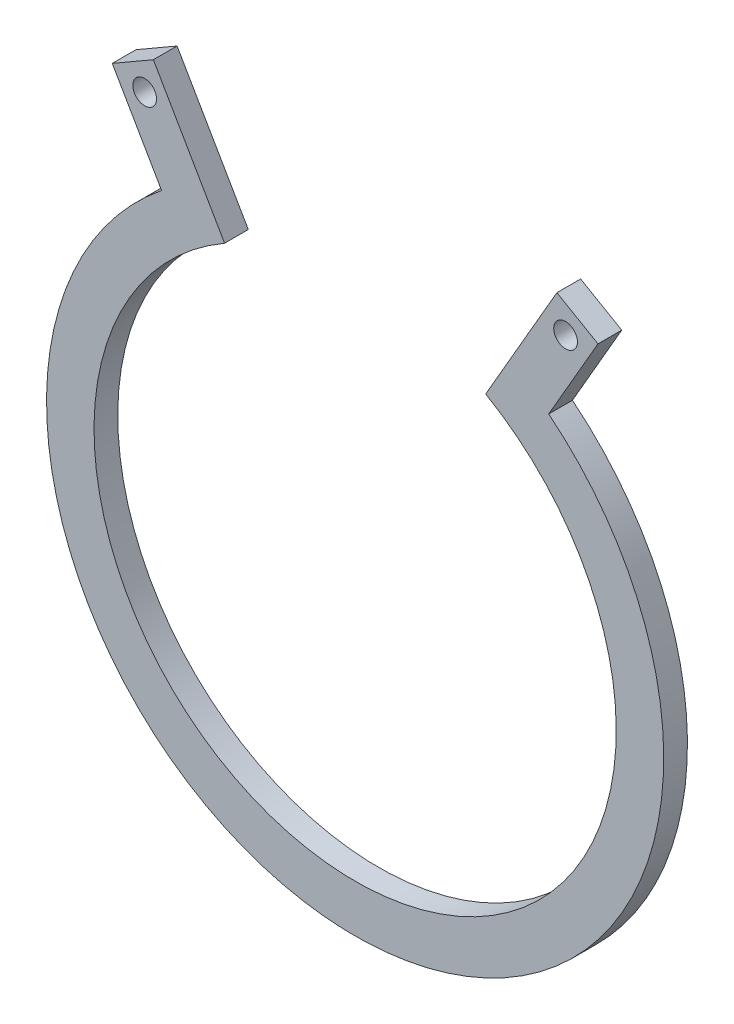
ISO-10303-21;
HEADER;
FILE_DESCRIPTION(('STEP AP214'),'2;1');
FILE_NAME('part.step','',(''),(''),'','','');
FILE_SCHEMA(('AUTOMOTIVE_DESIGN { 1 0 10303 214 1 1 1 1 }'));
ENDSEC;
DATA;
#1=APPLICATION_CONTEXT('core data for automotive mechanical design processes');
#2=APPLICATION_PROTOCOL_DEFINITION('international standard','automotive_design',2000,#1);
#3=PRODUCT_CONTEXT('',#1,'mechanical');
#4=PRODUCT('Part','Part','',(#3));
#5=PRODUCT_RELATED_PRODUCT_CATEGORY('part','',(#4));
#6=PRODUCT_DEFINITION_FORMATION('','',#4);
#7=PRODUCT_DEFINITION_CONTEXT('part definition',#1,'design');
#8=PRODUCT_DEFINITION('design','',#6,#7);
#9=PRODUCT_DEFINITION_SHAPE('','',#8);
#10=(LENGTH_UNIT() NAMED_UNIT(*) SI_UNIT(.MILLI.,.METRE.));
#11=(NAMED_UNIT(*) PLANE_ANGLE_UNIT() SI_UNIT($,.RADIAN.));
#12=(NAMED_UNIT(*) SI_UNIT($,.STERADIAN.) SOLID_ANGLE_UNIT());
#13=UNCERTAINTY_MEASURE_WITH_UNIT(LENGTH_MEASURE(1.E-05),#10,'distance_accuracy_value','');
#14=(GEOMETRIC_REPRESENTATION_CONTEXT(3) GLOBAL_UNCERTAINTY_ASSIGNED_CONTEXT((#13)) GLOBAL_UNIT_ASSIGNED_CONTEXT((#10,
#11,#12)) REPRESENTATION_CONTEXT('',''));
#15=CARTESIAN_POINT('',(0.,0.,0.));
#16=DIRECTION('',(0.,0.,1.));
#17=DIRECTION('',(1.,0.,0.));
#18=AXIS2_PLACEMENT_3D('',#15,#16,#17);
#19=CARTESIAN_POINT('',(0.,0.,3.175));
#20=DIRECTION('',(0.,0.,-1.));
#21=DIRECTION('',(-1.,0.,0.));
#22=AXIS2_PLACEMENT_3D('',#19,#20,#21);
#23=CYLINDRICAL_SURFACE('',#22,41.275);
#24=DIRECTION('',(0.,0.,1.));
#25=VECTOR('',#24,1.);
#26=CARTESIAN_POINT('',(25.8910680326626,32.1446452947927,-18.8026064702955));
#27=LINE('',#26,#25);
#28=CARTESIAN_POINT('',(25.8910680326626,32.1446452947927,0.));
#29=VERTEX_POINT('',#28);
#30=CARTESIAN_POINT('',(25.8910680326626,32.1446452947927,3.175));
#31=VERTEX_POINT('',#30);
#32=EDGE_CURVE('E58',#29,#31,#27,.T.);
#33=ORIENTED_EDGE('',*,*,#32,.T.);
#34=CARTESIAN_POINT('',(0.,0.,3.175));
#35=DIRECTION('',(0.,0.,1.));
#36=DIRECTION('',(1.,0.,0.));
#37=AXIS2_PLACEMENT_3D('',#34,#35,#36);
#38=CIRCLE('',#37,41.275);
#39=CARTESIAN_POINT('',(-25.8910680326626,32.1446452947927,3.175));
#40=VERTEX_POINT('',#39);
#41=EDGE_CURVE('E50',#40,#31,#38,.T.);
#42=ORIENTED_EDGE('',*,*,#41,.F.);
#43=DIRECTION('',(0.,0.,1.));
#44=VECTOR('',#43,1.);
#45=CARTESIAN_POINT('',(-25.8910680326626,32.1446452947927,-18.8026064702955));
#46=LINE('',#45,#44);
#47=CARTESIAN_POINT('',(-25.8910680326626,32.1446452947927,0.));
#48=VERTEX_POINT('',#47);
#49=EDGE_CURVE('E146',#48,#40,#46,.T.);
#50=ORIENTED_EDGE('',*,*,#49,.F.);
#51=CARTESIAN_POINT('',(0.,0.,0.));
#52=DIRECTION('',(0.,0.,1.));
#53=DIRECTION('',(1.,0.,0.));
#54=AXIS2_PLACEMENT_3D('',#51,#52,#53);
#55=CIRCLE('',#54,41.275);
#56=EDGE_CURVE('E63',#48,#29,#55,.T.);
#57=ORIENTED_EDGE('',*,*,#56,.T.);
#58=EDGE_LOOP('',(#33,#42,#50,#57));
#59=FACE_BOUND('',#58,.T.);
#60=ADVANCED_FACE('F41',(#59),#23,.T.);
#61=CARTESIAN_POINT('',(0.,0.,3.175));
#62=DIRECTION('',(0.,0.,-1.));
#63=DIRECTION('',(-1.,0.,0.));
#64=AXIS2_PLACEMENT_3D('',#61,#62,#63);
#65=CYLINDRICAL_SURFACE('',#64,34.925);
#66=DIRECTION('',(0.,0.,-1.));
#67=VECTOR('',#66,1.);
#68=CARTESIAN_POINT('',(17.4625,30.2459372271715,3.175));
#69=LINE('',#68,#67);
#70=CARTESIAN_POINT('',(17.4625,30.2459372271715,0.));
#71=VERTEX_POINT('',#70);
#72=CARTESIAN_POINT('',(17.4625,30.2459372271715,3.175));
#73=VERTEX_POINT('',#72);
#74=EDGE_CURVE('E127',#71,#73,#69,.F.);
#75=ORIENTED_EDGE('',*,*,#74,.F.);
#76=CARTESIAN_POINT('',(0.,0.,0.));
#77=DIRECTION('',(0.,0.,1.));
#78=DIRECTION('',(1.,0.,0.));
#79=AXIS2_PLACEMENT_3D('',#76,#77,#78);
#80=CIRCLE('',#79,34.925);
#81=CARTESIAN_POINT('',(-17.4625000000003,30.2459372271714,0.));
#82=VERTEX_POINT('',#81);
#83=EDGE_CURVE('E44',#82,#71,#80,.T.);
#84=ORIENTED_EDGE('',*,*,#83,.F.);
#85=DIRECTION('',(0.,0.,-1.));
#86=VECTOR('',#85,1.);
#87=CARTESIAN_POINT('',(-17.4625000000002,30.2459372271714,3.175));
#88=LINE('',#87,#86);
#89=CARTESIAN_POINT('',(-17.4625000000003,30.2459372271714,3.175));
#90=VERTEX_POINT('',#89);
#91=EDGE_CURVE('E120',#90,#82,#88,.T.);
#92=ORIENTED_EDGE('',*,*,#91,.F.);
#93=CARTESIAN_POINT('',(0.,0.,3.175));
#94=DIRECTION('',(0.,0.,1.));
#95=DIRECTION('',(1.,0.,0.));
#96=AXIS2_PLACEMENT_3D('',#93,#94,#95);
#97=CIRCLE('',#96,34.925);
#98=EDGE_CURVE('E11',#90,#73,#97,.T.);
#99=ORIENTED_EDGE('',*,*,#98,.T.);
#100=EDGE_LOOP('',(#75,#84,#92,#99));
#101=FACE_BOUND('',#100,.T.);
#102=ADVANCED_FACE('F130',(#101),#65,.F.);
#103=CARTESIAN_POINT('',(0.,0.,3.175));
#104=DIRECTION('',(0.,0.,1.));
#105=DIRECTION('',(1.,0.,0.));
#106=AXIS2_PLACEMENT_3D('',#103,#104,#105);
#107=PLANE('',#106);
#108=DIRECTION('',(-0.500000000000024,-0.866025403784425,0.));
#109=VECTOR('',#108,1.);
#110=CARTESIAN_POINT('',(-9.85518376771561E-13,5.6898930012042E-13,3.175));
#111=LINE('',#110,#109);
#112=CARTESIAN_POINT('',(26.9875000000003,46.7437211692649,3.175));
#113=VERTEX_POINT('',#112);
#114=EDGE_CURVE('E192',#113,#73,#111,.T.);
#115=ORIENTED_EDGE('',*,*,#114,.T.);
#116=ORIENTED_EDGE('',*,*,#98,.F.);
#117=DIRECTION('',(-0.5,0.866025403784439,0.));
#118=VECTOR('',#117,1.);
#119=CARTESIAN_POINT('',(-3.00462919747432E-13,-1.73472347597681E-13,3.175));
#120=LINE('',#119,#118);
#121=CARTESIAN_POINT('',(-26.9875000000003,46.7437211692649,3.175));
#122=VERTEX_POINT('',#121);
#123=EDGE_CURVE('E123',#90,#122,#120,.T.);
#124=ORIENTED_EDGE('',*,*,#123,.T.);
#125=DIRECTION('',(-0.866025403784435,-0.500000000000006,0.));
#126=VECTOR('',#125,1.);
#127=CARTESIAN_POINT('',(-26.9875000000003,46.7437211692649,3.175));
#128=LINE('',#127,#126);
#129=CARTESIAN_POINT('',(-32.4867613140314,43.5687211692648,3.175));
#130=VERTEX_POINT('',#129);
#131=EDGE_CURVE('E150',#122,#130,#128,.T.);
#132=ORIENTED_EDGE('',*,*,#131,.T.);
#133=DIRECTION('',(0.499999999999982,-0.866025403784449,0.));
#134=VECTOR('',#133,1.);
#135=CARTESIAN_POINT('',(-5.4992613140325,-3.17500000000061,3.175));
#136=LINE('',#135,#134);
#137=EDGE_CURVE('E164',#130,#40,#136,.T.);
#138=ORIENTED_EDGE('',*,*,#137,.T.);
#139=ORIENTED_EDGE('',*,*,#41,.T.);
#140=DIRECTION('',(-0.499999999999982,-0.866025403784449,0.));
#141=VECTOR('',#140,1.);
#142=CARTESIAN_POINT('',(5.49926131403254,-3.17500000000063,3.175));
#143=LINE('',#142,#141);
#144=CARTESIAN_POINT('',(32.4867613140314,43.5687211692649,3.175));
#145=VERTEX_POINT('',#144);
#146=EDGE_CURVE('E193',#145,#31,#143,.T.);
#147=ORIENTED_EDGE('',*,*,#146,.F.);
#148=DIRECTION('',(0.866025403784437,-0.500000000000003,0.));
#149=VECTOR('',#148,1.);
#150=CARTESIAN_POINT('',(26.9875000000001,46.743721169265,3.175));
#151=LINE('',#150,#149);
#152=EDGE_CURVE('E182',#113,#145,#151,.T.);
#153=ORIENTED_EDGE('',*,*,#152,.F.);
#154=EDGE_LOOP('',(#115,#116,#124,#132,#138,#139,#147,#153));
#155=FACE_BOUND('',#154,.T.);
#156=CARTESIAN_POINT('',(-28.1496306570159,42.4065905122492,3.175));
#157=DIRECTION('',(0.,0.,1.));
#158=DIRECTION('',(1.,0.,0.));
#159=AXIS2_PLACEMENT_3D('',#156,#157,#158);
#160=CIRCLE('',#159,1.58749999999999);
#161=CARTESIAN_POINT('',(-26.5621306570159,42.4065905122492,3.175));
#162=VERTEX_POINT('',#161);
#163=EDGE_CURVE('E151',#162,#162,#160,.T.);
#164=ORIENTED_EDGE('',*,*,#163,.F.);
#165=EDGE_LOOP('',(#164));
#166=FACE_BOUND('',#165,.T.);
#167=CARTESIAN_POINT('',(28.1496306570159,42.4065905122492,3.175));
#168=DIRECTION('',(0.,0.,1.));
#169=DIRECTION('',(1.,0.,0.));
#170=AXIS2_PLACEMENT_3D('',#167,#168,#169);
#171=CIRCLE('',#170,1.58749999999999);
#172=CARTESIAN_POINT('',(29.7371306570158,42.4065905122492,3.175));
#173=VERTEX_POINT('',#172);
#174=EDGE_CURVE('E174',#173,#173,#171,.F.);
#175=ORIENTED_EDGE('',*,*,#174,.T.);
#176=EDGE_LOOP('',(#175));
#177=FACE_BOUND('',#176,.T.);
#178=ADVANCED_FACE('F213',(#155,#166,#177),#107,.T.);
#179=CARTESIAN_POINT('',(0.,0.,0.));
#180=DIRECTION('',(0.,0.,1.));
#181=DIRECTION('',(1.,0.,0.));
#182=AXIS2_PLACEMENT_3D('',#179,#180,#181);
#183=PLANE('',#182);
#184=ORIENTED_EDGE('',*,*,#83,.T.);
#185=DIRECTION('',(0.500000000000024,0.866025403784425,0.));
#186=VECTOR('',#185,1.);
#187=CARTESIAN_POINT('',(-9.85518376771561E-13,5.6898930012042E-13,0.));
#188=LINE('',#187,#186);
#189=CARTESIAN_POINT('',(26.9875000000003,46.7437211692649,0.));
#190=VERTEX_POINT('',#189);
#191=EDGE_CURVE('E145',#71,#190,#188,.T.);
#192=ORIENTED_EDGE('',*,*,#191,.T.);
#193=DIRECTION('',(-0.866025403784437,0.500000000000003,0.));
#194=VECTOR('',#193,1.);
#195=CARTESIAN_POINT('',(26.9875000000001,46.743721169265,0.));
#196=LINE('',#195,#194);
#197=CARTESIAN_POINT('',(32.4867613140314,43.5687211692649,0.));
#198=VERTEX_POINT('',#197);
#199=EDGE_CURVE('E183',#198,#190,#196,.T.);
#200=ORIENTED_EDGE('',*,*,#199,.F.);
#201=DIRECTION('',(0.499999999999982,0.866025403784449,0.));
#202=VECTOR('',#201,1.);
#203=CARTESIAN_POINT('',(5.49926131403254,-3.17500000000063,0.));
#204=LINE('',#203,#202);
#205=EDGE_CURVE('E177',#29,#198,#204,.T.);
#206=ORIENTED_EDGE('',*,*,#205,.F.);
#207=ORIENTED_EDGE('',*,*,#56,.F.);
#208=DIRECTION('',(-0.499999999999982,0.866025403784449,0.));
#209=VECTOR('',#208,1.);
#210=CARTESIAN_POINT('',(-5.4992613140325,-3.17500000000061,0.));
#211=LINE('',#210,#209);
#212=CARTESIAN_POINT('',(-32.4867613140314,43.5687211692648,0.));
#213=VERTEX_POINT('',#212);
#214=EDGE_CURVE('E117',#48,#213,#211,.T.);
#215=ORIENTED_EDGE('',*,*,#214,.T.);
#216=DIRECTION('',(0.866025403784435,0.500000000000006,0.));
#217=VECTOR('',#216,1.);
#218=CARTESIAN_POINT('',(-26.9875000000003,46.7437211692649,0.));
#219=LINE('',#218,#217);
#220=CARTESIAN_POINT('',(-26.9875000000003,46.7437211692649,0.));
#221=VERTEX_POINT('',#220);
#222=EDGE_CURVE('E113',#213,#221,#219,.T.);
#223=ORIENTED_EDGE('',*,*,#222,.T.);
#224=DIRECTION('',(0.5,-0.866025403784439,0.));
#225=VECTOR('',#224,1.);
#226=CARTESIAN_POINT('',(-3.00462919747432E-13,-1.73472347597681E-13,0.));
#227=LINE('',#226,#225);
#228=EDGE_CURVE('E107',#221,#82,#227,.T.);
#229=ORIENTED_EDGE('',*,*,#228,.T.);
#230=EDGE_LOOP('',(#184,#192,#200,#206,#207,#215,#223,#229));
#231=FACE_BOUND('',#230,.T.);
#232=CARTESIAN_POINT('',(-28.1496306570159,42.4065905122492,0.));
#233=DIRECTION('',(0.,0.,1.));
#234=DIRECTION('',(1.,0.,0.));
#235=AXIS2_PLACEMENT_3D('',#232,#233,#234);
#236=CIRCLE('',#235,1.58749999999999);
#237=CARTESIAN_POINT('',(-26.5621306570159,42.4065905122492,0.));
#238=VERTEX_POINT('',#237);
#239=EDGE_CURVE('E153',#238,#238,#236,.F.);
#240=ORIENTED_EDGE('',*,*,#239,.F.);
#241=EDGE_LOOP('',(#240));
#242=FACE_BOUND('',#241,.T.);
#243=CARTESIAN_POINT('',(28.1496306570159,42.4065905122492,0.));
#244=DIRECTION('',(0.,0.,1.));
#245=DIRECTION('',(1.,0.,0.));
#246=AXIS2_PLACEMENT_3D('',#243,#244,#245);
#247=CIRCLE('',#246,1.58749999999999);
#248=CARTESIAN_POINT('',(29.7371306570158,42.4065905122492,0.));
#249=VERTEX_POINT('',#248);
#250=EDGE_CURVE('E170',#249,#249,#247,.T.);
#251=ORIENTED_EDGE('',*,*,#250,.T.);
#252=EDGE_LOOP('',(#251));
#253=FACE_BOUND('',#252,.T.);
#254=ADVANCED_FACE('F109',(#231,#242,#253),#183,.F.);
#255=CARTESIAN_POINT('',(-26.9875000000003,46.7437211692649,-18.8026064702955));
#256=DIRECTION('',(-0.500000000000006,0.866025403784435,0.));
#257=DIRECTION('',(-0.866025403784435,-0.500000000000006,0.));
#258=AXIS2_PLACEMENT_3D('',#255,#256,#257);
#259=PLANE('',#258);
#260=ORIENTED_EDGE('',*,*,#222,.F.);
#261=DIRECTION('',(0.,0.,1.));
#262=VECTOR('',#261,1.);
#263=CARTESIAN_POINT('',(-32.4867613140314,43.5687211692648,-18.8026064702955));
#264=LINE('',#263,#262);
#265=EDGE_CURVE('E141',#213,#130,#264,.T.);
#266=ORIENTED_EDGE('',*,*,#265,.T.);
#267=ORIENTED_EDGE('',*,*,#131,.F.);
#268=DIRECTION('',(0.,0.,1.));
#269=VECTOR('',#268,1.);
#270=CARTESIAN_POINT('',(-26.9875000000003,46.7437211692649,-18.8026064702955));
#271=LINE('',#270,#269);
#272=EDGE_CURVE('E144',#221,#122,#271,.T.);
#273=ORIENTED_EDGE('',*,*,#272,.F.);
#274=EDGE_LOOP('',(#260,#266,#267,#273));
#275=FACE_BOUND('',#274,.T.);
#276=ADVANCED_FACE('F242',(#275),#259,.T.);
#277=CARTESIAN_POINT('',(-3.00462919747432E-13,-1.73472347597681E-13,-18.8026064702955));
#278=DIRECTION('',(0.866025403784439,0.5,0.));
#279=DIRECTION('',(-0.5,0.866025403784439,0.));
#280=AXIS2_PLACEMENT_3D('',#277,#278,#279);
#281=PLANE('',#280);
#282=ORIENTED_EDGE('',*,*,#228,.F.);
#283=ORIENTED_EDGE('',*,*,#272,.T.);
#284=ORIENTED_EDGE('',*,*,#123,.F.);
#285=ORIENTED_EDGE('',*,*,#91,.T.);
#286=EDGE_LOOP('',(#282,#283,#284,#285));
#287=FACE_BOUND('',#286,.T.);
#288=ADVANCED_FACE('F121',(#287),#281,.T.);
#289=CARTESIAN_POINT('',(-28.1496306570159,42.4065905122492,-18.8026064702955));
#290=DIRECTION('',(0.,0.,1.));
#291=DIRECTION('',(1.,0.,0.));
#292=AXIS2_PLACEMENT_3D('',#289,#290,#291);
#293=CYLINDRICAL_SURFACE('',#292,1.58749999999999);
#294=ORIENTED_EDGE('',*,*,#239,.T.);
#295=EDGE_LOOP('',(#294));
#296=FACE_BOUND('',#295,.T.);
#297=ORIENTED_EDGE('',*,*,#163,.T.);
#298=EDGE_LOOP('',(#297));
#299=FACE_BOUND('',#298,.T.);
#300=ADVANCED_FACE('F249',(#296,#299),#293,.F.);
#301=CARTESIAN_POINT('',(-5.4992613140325,-3.17500000000061,-18.8026064702955));
#302=DIRECTION('',(-0.866025403784449,-0.499999999999982,0.));
#303=DIRECTION('',(0.499999999999982,-0.866025403784449,0.));
#304=AXIS2_PLACEMENT_3D('',#301,#302,#303);
#305=PLANE('',#304);
#306=ORIENTED_EDGE('',*,*,#214,.F.);
#307=ORIENTED_EDGE('',*,*,#49,.T.);
#308=ORIENTED_EDGE('',*,*,#137,.F.);
#309=ORIENTED_EDGE('',*,*,#265,.F.);
#310=EDGE_LOOP('',(#306,#307,#308,#309));
#311=FACE_BOUND('',#310,.T.);
#312=ADVANCED_FACE('F230',(#311),#305,.T.);
#313=CARTESIAN_POINT('',(26.9875000000001,46.743721169265,-18.8026064702955));
#314=DIRECTION('',(-0.500000000000002,-0.866025403784437,0.));
#315=DIRECTION('',(0.866025403784437,-0.500000000000003,0.));
#316=AXIS2_PLACEMENT_3D('',#313,#314,#315);
#317=PLANE('',#316);
#318=DIRECTION('',(0.,0.,1.));
#319=VECTOR('',#318,1.);
#320=CARTESIAN_POINT('',(32.4867613140314,43.5687211692649,-18.8026064702955));
#321=LINE('',#320,#319);
#322=EDGE_CURVE('E181',#198,#145,#321,.T.);
#323=ORIENTED_EDGE('',*,*,#322,.F.);
#324=ORIENTED_EDGE('',*,*,#199,.T.);
#325=DIRECTION('',(0.,0.,1.));
#326=VECTOR('',#325,1.);
#327=CARTESIAN_POINT('',(26.9875000000003,46.7437211692649,-18.8026064702955));
#328=LINE('',#327,#326);
#329=EDGE_CURVE('E187',#190,#113,#328,.T.);
#330=ORIENTED_EDGE('',*,*,#329,.T.);
#331=ORIENTED_EDGE('',*,*,#152,.T.);
#332=EDGE_LOOP('',(#323,#324,#330,#331));
#333=FACE_BOUND('',#332,.T.);
#334=ADVANCED_FACE('F219',(#333),#317,.F.);
#335=CARTESIAN_POINT('',(5.49926131403254,-3.17500000000063,-18.8026064702955));
#336=DIRECTION('',(-0.866025403784449,0.499999999999982,0.));
#337=DIRECTION('',(-0.499999999999982,-0.866025403784449,0.));
#338=AXIS2_PLACEMENT_3D('',#335,#336,#337);
#339=PLANE('',#338);
#340=ORIENTED_EDGE('',*,*,#32,.F.);
#341=ORIENTED_EDGE('',*,*,#205,.T.);
#342=ORIENTED_EDGE('',*,*,#322,.T.);
#343=ORIENTED_EDGE('',*,*,#146,.T.);
#344=EDGE_LOOP('',(#340,#341,#342,#343));
#345=FACE_BOUND('',#344,.T.);
#346=ADVANCED_FACE('F221',(#345),#339,.F.);
#347=CARTESIAN_POINT('',(-9.85518376771561E-13,5.6898930012042E-13,-18.8026064702955));
#348=DIRECTION('',(-0.866025403784425,0.500000000000024,0.));
#349=DIRECTION('',(-0.500000000000024,-0.866025403784425,0.));
#350=AXIS2_PLACEMENT_3D('',#347,#348,#349);
#351=PLANE('',#350);
#352=ORIENTED_EDGE('',*,*,#191,.F.);
#353=ORIENTED_EDGE('',*,*,#74,.T.);
#354=ORIENTED_EDGE('',*,*,#114,.F.);
#355=ORIENTED_EDGE('',*,*,#329,.F.);
#356=EDGE_LOOP('',(#352,#353,#354,#355));
#357=FACE_BOUND('',#356,.T.);
#358=ADVANCED_FACE('F210',(#357),#351,.T.);
#359=CARTESIAN_POINT('',(28.1496306570159,42.4065905122492,-18.8026064702955));
#360=DIRECTION('',(0.,0.,1.));
#361=DIRECTION('',(1.,0.,0.));
#362=AXIS2_PLACEMENT_3D('',#359,#360,#361);
#363=CYLINDRICAL_SURFACE('',#362,1.58749999999999);
#364=ORIENTED_EDGE('',*,*,#250,.F.);
#365=EDGE_LOOP('',(#364));
#366=FACE_BOUND('',#365,.T.);
#367=ORIENTED_EDGE('',*,*,#174,.F.);
#368=EDGE_LOOP('',(#367));
#369=FACE_BOUND('',#368,.T.);
#370=ADVANCED_FACE('F228',(#366,#369),#363,.F.);
#371=CLOSED_SHELL('',(#60,#102,#178,#254,#276,#288,#300,#312,#334,#346,#358,#370));
#372=MANIFOLD_SOLID_BREP('B2',#371);
#373=ADVANCED_BREP_SHAPE_REPRESENTATION('',(#18,#372),#14);
#374=SHAPE_DEFINITION_REPRESENTATION(#9,#373);
ENDSEC;
END-ISO-10303-21;
